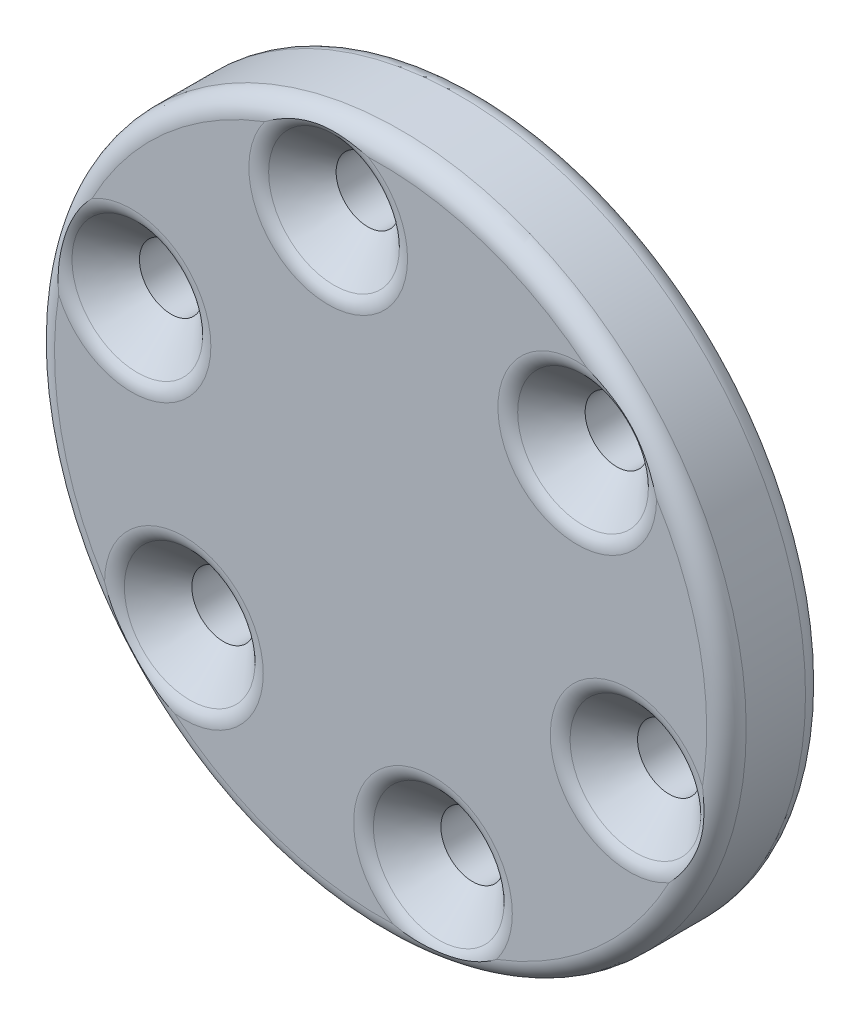
ISO-10303-21;
HEADER;
FILE_DESCRIPTION(('STEP AP214'),'2;1');
FILE_NAME('part.step','',(''),(''),'','','');
FILE_SCHEMA(('AUTOMOTIVE_DESIGN { 1 0 10303 214 1 1 1 1 }'));
ENDSEC;
DATA;
#1=APPLICATION_CONTEXT('core data for automotive mechanical design processes');
#2=APPLICATION_PROTOCOL_DEFINITION('international standard','automotive_design',2000,#1);
#3=PRODUCT_CONTEXT('',#1,'mechanical');
#4=PRODUCT('Part','Part','',(#3));
#5=PRODUCT_RELATED_PRODUCT_CATEGORY('part','',(#4));
#6=PRODUCT_DEFINITION_FORMATION('','',#4);
#7=PRODUCT_DEFINITION_CONTEXT('part definition',#1,'design');
#8=PRODUCT_DEFINITION('design','',#6,#7);
#9=PRODUCT_DEFINITION_SHAPE('','',#8);
#10=(LENGTH_UNIT() NAMED_UNIT(*) SI_UNIT(.MILLI.,.METRE.));
#11=(NAMED_UNIT(*) PLANE_ANGLE_UNIT() SI_UNIT($,.RADIAN.));
#12=(NAMED_UNIT(*) SI_UNIT($,.STERADIAN.) SOLID_ANGLE_UNIT());
#13=UNCERTAINTY_MEASURE_WITH_UNIT(LENGTH_MEASURE(1.E-05),#10,'distance_accuracy_value','');
#14=(GEOMETRIC_REPRESENTATION_CONTEXT(3) GLOBAL_UNCERTAINTY_ASSIGNED_CONTEXT((#13)) GLOBAL_UNIT_ASSIGNED_CONTEXT((#10,
#11,#12)) REPRESENTATION_CONTEXT('',''));
#15=CARTESIAN_POINT('',(0.,0.,0.));
#16=DIRECTION('',(0.,0.,1.));
#17=DIRECTION('',(1.,0.,0.));
#18=AXIS2_PLACEMENT_3D('',#15,#16,#17);
#19=CARTESIAN_POINT('',(-2.65015327966238,13.0205565443838,5.));
#20=DIRECTION('',(0.,0.,-1.));
#21=DIRECTION('',(-1.,0.,0.));
#22=AXIS2_PLACEMENT_3D('',#19,#20,#21);
#23=CYLINDRICAL_SURFACE('',#22,1.6);
#24=CARTESIAN_POINT('',(-2.65015327966238,13.0205565443838,1.));
#25=DIRECTION('',(0.,0.,1.));
#26=DIRECTION('',(1.,0.,0.));
#27=AXIS2_PLACEMENT_3D('',#24,#25,#26);
#28=CIRCLE('',#27,1.6);
#29=CARTESIAN_POINT('',(-1.05015327966238,13.0205565443838,1.));
#30=VERTEX_POINT('',#29);
#31=EDGE_CURVE('E348',#30,#30,#28,.F.);
#32=ORIENTED_EDGE('',*,*,#31,.T.);
#33=EDGE_LOOP('',(#32));
#34=FACE_BOUND('',#33,.T.);
#35=CARTESIAN_POINT('',(-2.65015327966238,13.0205565443838,3.));
#36=DIRECTION('',(0.,0.,1.));
#37=DIRECTION('',(1.,0.,0.));
#38=AXIS2_PLACEMENT_3D('',#35,#36,#37);
#39=CIRCLE('',#38,1.6);
#40=CARTESIAN_POINT('',(-1.05015327966238,13.0205565443838,3.));
#41=VERTEX_POINT('',#40);
#42=EDGE_CURVE('E635',#41,#41,#39,.T.);
#43=ORIENTED_EDGE('',*,*,#42,.T.);
#44=EDGE_LOOP('',(#43));
#45=FACE_BOUND('',#44,.T.);
#46=ADVANCED_FACE('F36',(#34,#45),#23,.F.);
#47=CARTESIAN_POINT('',(9.95105609901738,8.80537833630347,5.));
#48=DIRECTION('',(0.,0.,-1.));
#49=DIRECTION('',(-1.,0.,0.));
#50=AXIS2_PLACEMENT_3D('',#47,#48,#49);
#51=CYLINDRICAL_SURFACE('',#50,1.6);
#52=CARTESIAN_POINT('',(9.95105609901738,8.80537833630347,1.));
#53=DIRECTION('',(0.,0.,1.));
#54=DIRECTION('',(1.,0.,0.));
#55=AXIS2_PLACEMENT_3D('',#52,#53,#54);
#56=CIRCLE('',#55,1.6);
#57=CARTESIAN_POINT('',(11.5510560990174,8.80537833630347,1.));
#58=VERTEX_POINT('',#57);
#59=EDGE_CURVE('E350',#58,#58,#56,.F.);
#60=ORIENTED_EDGE('',*,*,#59,.T.);
#61=EDGE_LOOP('',(#60));
#62=FACE_BOUND('',#61,.T.);
#63=CARTESIAN_POINT('',(9.95105609901738,8.80537833630347,3.));
#64=DIRECTION('',(0.,0.,1.));
#65=DIRECTION('',(1.,0.,0.));
#66=AXIS2_PLACEMENT_3D('',#63,#64,#65);
#67=CIRCLE('',#66,1.6);
#68=CARTESIAN_POINT('',(11.5510560990174,8.80537833630347,3.));
#69=VERTEX_POINT('',#68);
#70=EDGE_CURVE('E637',#69,#69,#67,.T.);
#71=ORIENTED_EDGE('',*,*,#70,.T.);
#72=EDGE_LOOP('',(#71));
#73=FACE_BOUND('',#72,.T.);
#74=ADVANCED_FACE('F240',(#62,#73),#51,.F.);
#75=CARTESIAN_POINT('',(12.6012093786812,-4.21517820808008,5.));
#76=DIRECTION('',(0.,0.,-1.));
#77=DIRECTION('',(-1.,0.,0.));
#78=AXIS2_PLACEMENT_3D('',#75,#76,#77);
#79=CYLINDRICAL_SURFACE('',#78,1.6);
#80=CARTESIAN_POINT('',(12.6012093786812,-4.21517820808008,1.));
#81=DIRECTION('',(0.,0.,1.));
#82=DIRECTION('',(1.,0.,0.));
#83=AXIS2_PLACEMENT_3D('',#80,#81,#82);
#84=CIRCLE('',#83,1.6);
#85=CARTESIAN_POINT('',(14.2012093786812,-4.21517820808008,1.));
#86=VERTEX_POINT('',#85);
#87=EDGE_CURVE('E353',#86,#86,#84,.F.);
#88=ORIENTED_EDGE('',*,*,#87,.T.);
#89=EDGE_LOOP('',(#88));
#90=FACE_BOUND('',#89,.T.);
#91=CARTESIAN_POINT('',(12.6012093786812,-4.21517820808008,3.));
#92=DIRECTION('',(0.,0.,1.));
#93=DIRECTION('',(1.,0.,0.));
#94=AXIS2_PLACEMENT_3D('',#91,#92,#93);
#95=CIRCLE('',#94,1.6);
#96=CARTESIAN_POINT('',(14.2012093786812,-4.21517820808008,3.));
#97=VERTEX_POINT('',#96);
#98=EDGE_CURVE('E370',#97,#97,#95,.T.);
#99=ORIENTED_EDGE('',*,*,#98,.T.);
#100=EDGE_LOOP('',(#99));
#101=FACE_BOUND('',#100,.T.);
#102=ADVANCED_FACE('F246',(#90,#101),#79,.F.);
#103=CARTESIAN_POINT('',(2.65015327966517,-13.0205565443833,5.));
#104=DIRECTION('',(0.,0.,-1.));
#105=DIRECTION('',(-1.,0.,0.));
#106=AXIS2_PLACEMENT_3D('',#103,#104,#105);
#107=CYLINDRICAL_SURFACE('',#106,1.6);
#108=CARTESIAN_POINT('',(2.65015327966517,-13.0205565443833,1.));
#109=DIRECTION('',(0.,0.,1.));
#110=DIRECTION('',(1.,0.,0.));
#111=AXIS2_PLACEMENT_3D('',#108,#109,#110);
#112=CIRCLE('',#111,1.6);
#113=CARTESIAN_POINT('',(4.25015327966517,-13.0205565443833,1.));
#114=VERTEX_POINT('',#113);
#115=EDGE_CURVE('E356',#114,#114,#112,.F.);
#116=ORIENTED_EDGE('',*,*,#115,.T.);
#117=EDGE_LOOP('',(#116));
#118=FACE_BOUND('',#117,.T.);
#119=CARTESIAN_POINT('',(2.65015327966517,-13.0205565443833,3.));
#120=DIRECTION('',(0.,0.,1.));
#121=DIRECTION('',(1.,0.,0.));
#122=AXIS2_PLACEMENT_3D('',#119,#120,#121);
#123=CIRCLE('',#122,1.6);
#124=CARTESIAN_POINT('',(4.25015327966517,-13.0205565443833,3.));
#125=VERTEX_POINT('',#124);
#126=EDGE_CURVE('E364',#125,#125,#123,.T.);
#127=ORIENTED_EDGE('',*,*,#126,.T.);
#128=EDGE_LOOP('',(#127));
#129=FACE_BOUND('',#128,.T.);
#130=ADVANCED_FACE('F257',(#118,#129),#107,.F.);
#131=CARTESIAN_POINT('',(-9.95105609901459,-8.80537833630304,5.));
#132=DIRECTION('',(0.,0.,-1.));
#133=DIRECTION('',(-1.,0.,0.));
#134=AXIS2_PLACEMENT_3D('',#131,#132,#133);
#135=CYLINDRICAL_SURFACE('',#134,1.6);
#136=CARTESIAN_POINT('',(-9.95105609901459,-8.80537833630304,1.));
#137=DIRECTION('',(0.,0.,1.));
#138=DIRECTION('',(1.,0.,0.));
#139=AXIS2_PLACEMENT_3D('',#136,#137,#138);
#140=CIRCLE('',#139,1.6);
#141=CARTESIAN_POINT('',(-8.35105609901459,-8.80537833630304,1.));
#142=VERTEX_POINT('',#141);
#143=EDGE_CURVE('E120',#142,#142,#140,.F.);
#144=ORIENTED_EDGE('',*,*,#143,.T.);
#145=EDGE_LOOP('',(#144));
#146=FACE_BOUND('',#145,.T.);
#147=CARTESIAN_POINT('',(-9.95105609901459,-8.80537833630304,3.));
#148=DIRECTION('',(0.,0.,1.));
#149=DIRECTION('',(1.,0.,0.));
#150=AXIS2_PLACEMENT_3D('',#147,#148,#149);
#151=CIRCLE('',#150,1.6);
#152=CARTESIAN_POINT('',(-8.35105609901459,-8.80537833630304,3.));
#153=VERTEX_POINT('',#152);
#154=EDGE_CURVE('E361',#153,#153,#151,.T.);
#155=ORIENTED_EDGE('',*,*,#154,.T.);
#156=EDGE_LOOP('',(#155));
#157=FACE_BOUND('',#156,.T.);
#158=ADVANCED_FACE('F261',(#146,#157),#135,.F.);
#159=CARTESIAN_POINT('',(-12.6012093786784,4.21517820808051,5.));
#160=DIRECTION('',(0.,0.,-1.));
#161=DIRECTION('',(-1.,0.,0.));
#162=AXIS2_PLACEMENT_3D('',#159,#160,#161);
#163=CYLINDRICAL_SURFACE('',#162,1.6);
#164=CARTESIAN_POINT('',(-12.6012093786784,4.21517820808051,1.));
#165=DIRECTION('',(0.,0.,1.));
#166=DIRECTION('',(1.,0.,0.));
#167=AXIS2_PLACEMENT_3D('',#164,#165,#166);
#168=CIRCLE('',#167,1.6);
#169=CARTESIAN_POINT('',(-11.0012093786784,4.21517820808051,1.));
#170=VERTEX_POINT('',#169);
#171=EDGE_CURVE('E117',#170,#170,#168,.F.);
#172=ORIENTED_EDGE('',*,*,#171,.T.);
#173=EDGE_LOOP('',(#172));
#174=FACE_BOUND('',#173,.T.);
#175=CARTESIAN_POINT('',(-12.6012093786784,4.21517820808051,3.));
#176=DIRECTION('',(0.,0.,1.));
#177=DIRECTION('',(1.,0.,0.));
#178=AXIS2_PLACEMENT_3D('',#175,#176,#177);
#179=CIRCLE('',#178,1.6);
#180=CARTESIAN_POINT('',(-11.0012093786784,4.21517820808051,3.));
#181=VERTEX_POINT('',#180);
#182=EDGE_CURVE('E363',#181,#181,#179,.T.);
#183=ORIENTED_EDGE('',*,*,#182,.T.);
#184=EDGE_LOOP('',(#183));
#185=FACE_BOUND('',#184,.T.);
#186=ADVANCED_FACE('F265',(#174,#185),#163,.F.);
#187=CARTESIAN_POINT('',(0.,0.,5.));
#188=DIRECTION('',(0.,0.,-1.));
#189=DIRECTION('',(-1.,0.,0.));
#190=AXIS2_PLACEMENT_3D('',#187,#188,#189);
#191=CYLINDRICAL_SURFACE('',#190,17.5);
#192=CARTESIAN_POINT('',(0.,0.,1.));
#193=DIRECTION('',(0.,0.,1.));
#194=DIRECTION('',(1.,0.,0.));
#195=AXIS2_PLACEMENT_3D('',#192,#193,#194);
#196=CIRCLE('',#195,17.5);
#197=CARTESIAN_POINT('',(17.5,0.,1.));
#198=VERTEX_POINT('',#197);
#199=EDGE_CURVE('E333',#198,#198,#196,.T.);
#200=ORIENTED_EDGE('',*,*,#199,.T.);
#201=EDGE_LOOP('',(#200));
#202=FACE_BOUND('',#201,.T.);
#203=CARTESIAN_POINT('',(0.,0.,4.));
#204=DIRECTION('',(0.,0.,1.));
#205=DIRECTION('',(1.,0.,0.));
#206=AXIS2_PLACEMENT_3D('',#203,#204,#205);
#207=CIRCLE('',#206,17.5);
#208=CARTESIAN_POINT('',(17.5,0.,4.));
#209=VERTEX_POINT('',#208);
#210=EDGE_CURVE('E367',#209,#209,#207,.F.);
#211=ORIENTED_EDGE('',*,*,#210,.T.);
#212=EDGE_LOOP('',(#211));
#213=FACE_BOUND('',#212,.T.);
#214=ADVANCED_FACE('F252',(#202,#213),#191,.T.);
#215=CARTESIAN_POINT('',(0.,0.,5.));
#216=DIRECTION('',(0.,0.,1.));
#217=DIRECTION('',(1.,0.,0.));
#218=AXIS2_PLACEMENT_3D('',#215,#216,#217);
#219=PLANE('',#218);
#220=CARTESIAN_POINT('',(-9.95105609901459,-8.80537833630304,5.));
#221=DIRECTION('',(0.,0.,1.));
#222=DIRECTION('',(1.,0.,0.));
#223=AXIS2_PLACEMENT_3D('',#220,#221,#222);
#224=CIRCLE('',#223,4.0142135623731);
#225=CARTESIAN_POINT('',(-13.96523039974,-8.78762424561829,5.));
#226=VERTEX_POINT('',#225);
#227=CARTESIAN_POINT('',(-5.93684253664149,-8.80537833630304,5.));
#228=VERTEX_POINT('',#227);
#229=EDGE_CURVE('E63',#226,#228,#224,.F.);
#230=ORIENTED_EDGE('',*,*,#229,.T.);
#231=CARTESIAN_POINT('',(-9.95105609901459,-8.80537833630304,5.));
#232=DIRECTION('',(0.,0.,1.));
#233=DIRECTION('',(1.,0.,0.));
#234=AXIS2_PLACEMENT_3D('',#231,#232,#233);
#235=CIRCLE('',#234,4.0142135623731);
#236=CARTESIAN_POINT('',(-10.4219975750643,-12.7918711119739,5.));
#237=VERTEX_POINT('',#236);
#238=EDGE_CURVE('E58',#228,#237,#235,.F.);
#239=ORIENTED_EDGE('',*,*,#238,.T.);
#240=CARTESIAN_POINT('',(0.,0.,5.));
#241=DIRECTION('',(0.,0.,1.));
#242=DIRECTION('',(1.,0.,0.));
#243=AXIS2_PLACEMENT_3D('',#240,#241,#242);
#244=CIRCLE('',#243,16.5);
#245=CARTESIAN_POINT('',(0.627690635746586,-16.4880564186867,5.));
#246=VERTEX_POINT('',#245);
#247=EDGE_CURVE('E146',#237,#246,#244,.T.);
#248=ORIENTED_EDGE('',*,*,#247,.T.);
#249=CARTESIAN_POINT('',(2.65015327966517,-13.0205565443833,5.));
#250=DIRECTION('',(0.,0.,1.));
#251=DIRECTION('',(1.,0.,0.));
#252=AXIS2_PLACEMENT_3D('',#249,#250,#251);
#253=CIRCLE('',#252,4.0142135623731);
#254=CARTESIAN_POINT('',(6.66436684203827,-13.0205565443833,5.));
#255=VERTEX_POINT('',#254);
#256=EDGE_CURVE('E143',#246,#255,#253,.F.);
#257=ORIENTED_EDGE('',*,*,#256,.T.);
#258=CARTESIAN_POINT('',(2.65015327966517,-13.0205565443833,5.));
#259=DIRECTION('',(0.,0.,1.));
#260=DIRECTION('',(1.,0.,0.));
#261=AXIS2_PLACEMENT_3D('',#258,#259,#260);
#262=CIRCLE('',#261,4.0142135623731);
#263=CARTESIAN_POINT('',(5.86708655737593,-15.4216502141716,5.));
#264=VERTEX_POINT('',#263);
#265=EDGE_CURVE('E141',#255,#264,#262,.F.);
#266=ORIENTED_EDGE('',*,*,#265,.T.);
#267=CARTESIAN_POINT('',(0.,0.,5.));
#268=DIRECTION('',(0.,0.,1.));
#269=DIRECTION('',(1.,0.,0.));
#270=AXIS2_PLACEMENT_3D('',#267,#268,#269);
#271=CIRCLE('',#270,16.5);
#272=CARTESIAN_POINT('',(14.5929210354858,-7.70043217307151,5.));
#273=VERTEX_POINT('',#272);
#274=EDGE_CURVE('E137',#264,#273,#271,.T.);
#275=ORIENTED_EDGE('',*,*,#274,.T.);
#276=CARTESIAN_POINT('',(12.6012093786812,-4.21517820808008,5.));
#277=DIRECTION('',(0.,0.,1.));
#278=DIRECTION('',(1.,0.,0.));
#279=AXIS2_PLACEMENT_3D('',#276,#277,#278);
#280=CIRCLE('',#279,4.0142135623731);
#281=CARTESIAN_POINT('',(16.2890841324384,-2.62977910219536,5.));
#282=VERTEX_POINT('',#281);
#283=EDGE_CURVE('E133',#273,#282,#280,.F.);
#284=ORIENTED_EDGE('',*,*,#283,.T.);
#285=CARTESIAN_POINT('',(0.,0.,5.));
#286=DIRECTION('',(0.,0.,1.));
#287=DIRECTION('',(1.,0.,0.));
#288=AXIS2_PLACEMENT_3D('',#285,#286,#287);
#289=CIRCLE('',#288,16.5);
#290=CARTESIAN_POINT('',(13.9652303997427,8.78762424561389,5.));
#291=VERTEX_POINT('',#290);
#292=EDGE_CURVE('E131',#282,#291,#289,.T.);
#293=ORIENTED_EDGE('',*,*,#292,.T.);
#294=CARTESIAN_POINT('',(9.95105609901738,8.80537833630347,5.));
#295=DIRECTION('',(0.,0.,1.));
#296=DIRECTION('',(1.,0.,0.));
#297=AXIS2_PLACEMENT_3D('',#294,#295,#296);
#298=CIRCLE('',#297,4.0142135623731);
#299=CARTESIAN_POINT('',(10.4219975750632,12.7918711119748,5.));
#300=VERTEX_POINT('',#299);
#301=EDGE_CURVE('E127',#291,#300,#298,.F.);
#302=ORIENTED_EDGE('',*,*,#301,.T.);
#303=CARTESIAN_POINT('',(0.,0.,5.));
#304=DIRECTION('',(0.,0.,1.));
#305=DIRECTION('',(1.,0.,0.));
#306=AXIS2_PLACEMENT_3D('',#303,#304,#305);
#307=CIRCLE('',#306,16.5);
#308=CARTESIAN_POINT('',(-0.627690635743248,16.4880564186868,5.));
#309=VERTEX_POINT('',#308);
#310=EDGE_CURVE('E111',#300,#309,#307,.T.);
#311=ORIENTED_EDGE('',*,*,#310,.T.);
#312=CARTESIAN_POINT('',(-2.65015327966238,13.0205565443838,5.));
#313=DIRECTION('',(0.,0.,1.));
#314=DIRECTION('',(1.,0.,0.));
#315=AXIS2_PLACEMENT_3D('',#312,#313,#314);
#316=CIRCLE('',#315,4.0142135623731);
#317=CARTESIAN_POINT('',(1.36406028271072,13.0205565443838,5.));
#318=VERTEX_POINT('',#317);
#319=EDGE_CURVE('E104',#309,#318,#316,.F.);
#320=ORIENTED_EDGE('',*,*,#319,.T.);
#321=CARTESIAN_POINT('',(-2.65015327966238,13.0205565443838,5.));
#322=DIRECTION('',(0.,0.,1.));
#323=DIRECTION('',(1.,0.,0.));
#324=AXIS2_PLACEMENT_3D('',#321,#322,#323);
#325=CIRCLE('',#324,4.0142135623731);
#326=CARTESIAN_POINT('',(-5.8670865573725,15.4216502141729,5.));
#327=VERTEX_POINT('',#326);
#328=EDGE_CURVE('E108',#318,#327,#325,.F.);
#329=ORIENTED_EDGE('',*,*,#328,.T.);
#330=CARTESIAN_POINT('',(0.,0.,5.));
#331=DIRECTION('',(0.,0.,1.));
#332=DIRECTION('',(1.,0.,0.));
#333=AXIS2_PLACEMENT_3D('',#330,#331,#332);
#334=CIRCLE('',#333,16.5);
#335=CARTESIAN_POINT('',(-14.5929210354867,7.70043217306982,5.));
#336=VERTEX_POINT('',#335);
#337=EDGE_CURVE('E125',#327,#336,#334,.T.);
#338=ORIENTED_EDGE('',*,*,#337,.T.);
#339=CARTESIAN_POINT('',(-12.6012093786784,4.21517820808051,5.));
#340=DIRECTION('',(0.,0.,1.));
#341=DIRECTION('',(1.,0.,0.));
#342=AXIS2_PLACEMENT_3D('',#339,#340,#341);
#343=CIRCLE('',#342,4.0142135623731);
#344=CARTESIAN_POINT('',(-8.58699581630528,4.21517820808051,5.));
#345=VERTEX_POINT('',#344);
#346=EDGE_CURVE('E129',#336,#345,#343,.F.);
#347=ORIENTED_EDGE('',*,*,#346,.T.);
#348=CARTESIAN_POINT('',(-12.6012093786784,4.21517820808051,5.));
#349=DIRECTION('',(0.,0.,1.));
#350=DIRECTION('',(1.,0.,0.));
#351=AXIS2_PLACEMENT_3D('',#348,#349,#350);
#352=CIRCLE('',#351,4.0142135623731);
#353=CARTESIAN_POINT('',(-16.2890841324376,2.62977910220041,5.));
#354=VERTEX_POINT('',#353);
#355=EDGE_CURVE('E135',#345,#354,#352,.F.);
#356=ORIENTED_EDGE('',*,*,#355,.T.);
#357=CARTESIAN_POINT('',(0.,0.,5.));
#358=DIRECTION('',(0.,0.,1.));
#359=DIRECTION('',(1.,0.,0.));
#360=AXIS2_PLACEMENT_3D('',#357,#358,#359);
#361=CIRCLE('',#360,16.5);
#362=EDGE_CURVE('E139',#354,#226,#361,.T.);
#363=ORIENTED_EDGE('',*,*,#362,.T.);
#364=EDGE_LOOP('',(#230,#239,#248,#257,#266,#275,#284,#293,#302,#311,#320,#329,#338,#347,#356,#363));
#365=FACE_BOUND('',#364,.T.);
#366=ADVANCED_FACE('F106',(#365),#219,.T.);
#367=CARTESIAN_POINT('',(0.,0.,0.));
#368=DIRECTION('',(0.,0.,1.));
#369=DIRECTION('',(1.,0.,0.));
#370=AXIS2_PLACEMENT_3D('',#367,#368,#369);
#371=PLANE('',#370);
#372=CARTESIAN_POINT('',(0.,0.,0.));
#373=DIRECTION('',(0.,0.,1.));
#374=DIRECTION('',(1.,0.,0.));
#375=AXIS2_PLACEMENT_3D('',#372,#373,#374);
#376=CIRCLE('',#375,16.5);
#377=CARTESIAN_POINT('',(16.5,0.,0.));
#378=VERTEX_POINT('',#377);
#379=EDGE_CURVE('E345',#378,#378,#376,.F.);
#380=ORIENTED_EDGE('',*,*,#379,.T.);
#381=EDGE_LOOP('',(#380));
#382=FACE_BOUND('',#381,.T.);
#383=CARTESIAN_POINT('',(-2.65015327966238,13.0205565443838,0.));
#384=DIRECTION('',(0.,0.,1.));
#385=DIRECTION('',(1.,0.,0.));
#386=AXIS2_PLACEMENT_3D('',#383,#384,#385);
#387=CIRCLE('',#386,2.6);
#388=CARTESIAN_POINT('',(-0.0501532796623808,13.0205565443838,0.));
#389=VERTEX_POINT('',#388);
#390=EDGE_CURVE('E342',#389,#389,#387,.T.);
#391=ORIENTED_EDGE('',*,*,#390,.T.);
#392=EDGE_LOOP('',(#391));
#393=FACE_BOUND('',#392,.T.);
#394=CARTESIAN_POINT('',(9.95105609901738,8.80537833630347,0.));
#395=DIRECTION('',(0.,0.,1.));
#396=DIRECTION('',(1.,0.,0.));
#397=AXIS2_PLACEMENT_3D('',#394,#395,#396);
#398=CIRCLE('',#397,2.6);
#399=CARTESIAN_POINT('',(12.5510560990174,8.80537833630347,0.));
#400=VERTEX_POINT('',#399);
#401=EDGE_CURVE('E339',#400,#400,#398,.T.);
#402=ORIENTED_EDGE('',*,*,#401,.T.);
#403=EDGE_LOOP('',(#402));
#404=FACE_BOUND('',#403,.T.);
#405=CARTESIAN_POINT('',(12.6012093786812,-4.21517820808008,0.));
#406=DIRECTION('',(0.,0.,1.));
#407=DIRECTION('',(1.,0.,0.));
#408=AXIS2_PLACEMENT_3D('',#405,#406,#407);
#409=CIRCLE('',#408,2.6);
#410=CARTESIAN_POINT('',(15.2012093786812,-4.21517820808008,0.));
#411=VERTEX_POINT('',#410);
#412=EDGE_CURVE('E330',#411,#411,#409,.T.);
#413=ORIENTED_EDGE('',*,*,#412,.T.);
#414=EDGE_LOOP('',(#413));
#415=FACE_BOUND('',#414,.T.);
#416=CARTESIAN_POINT('',(2.65015327966517,-13.0205565443833,0.));
#417=DIRECTION('',(0.,0.,1.));
#418=DIRECTION('',(1.,0.,0.));
#419=AXIS2_PLACEMENT_3D('',#416,#417,#418);
#420=CIRCLE('',#419,2.6);
#421=CARTESIAN_POINT('',(5.25015327966517,-13.0205565443833,0.));
#422=VERTEX_POINT('',#421);
#423=EDGE_CURVE('E326',#422,#422,#420,.T.);
#424=ORIENTED_EDGE('',*,*,#423,.T.);
#425=EDGE_LOOP('',(#424));
#426=FACE_BOUND('',#425,.T.);
#427=CARTESIAN_POINT('',(-9.95105609901459,-8.80537833630304,0.));
#428=DIRECTION('',(0.,0.,1.));
#429=DIRECTION('',(1.,0.,0.));
#430=AXIS2_PLACEMENT_3D('',#427,#428,#429);
#431=CIRCLE('',#430,2.6);
#432=CARTESIAN_POINT('',(-7.35105609901459,-8.80537833630304,0.));
#433=VERTEX_POINT('',#432);
#434=EDGE_CURVE('E324',#433,#433,#431,.T.);
#435=ORIENTED_EDGE('',*,*,#434,.T.);
#436=EDGE_LOOP('',(#435));
#437=FACE_BOUND('',#436,.T.);
#438=CARTESIAN_POINT('',(-12.6012093786784,4.21517820808051,0.));
#439=DIRECTION('',(0.,0.,1.));
#440=DIRECTION('',(1.,0.,0.));
#441=AXIS2_PLACEMENT_3D('',#438,#439,#440);
#442=CIRCLE('',#441,2.6);
#443=CARTESIAN_POINT('',(-10.0012093786784,4.21517820808051,0.));
#444=VERTEX_POINT('',#443);
#445=EDGE_CURVE('E327',#444,#444,#442,.T.);
#446=ORIENTED_EDGE('',*,*,#445,.T.);
#447=EDGE_LOOP('',(#446));
#448=FACE_BOUND('',#447,.T.);
#449=ADVANCED_FACE('F274',(#382,#393,#404,#415,#426,#437,#448),#371,.F.);
#450=CARTESIAN_POINT('',(-2.65015327966238,13.0205565443838,3.));
#451=DIRECTION('',(0.,0.,1.));
#452=DIRECTION('',(1.,0.,0.));
#453=AXIS2_PLACEMENT_3D('',#450,#451,#452);
#454=CONICAL_SURFACE('',#453,1.6,0.785398163397449);
#455=CARTESIAN_POINT('',(-2.65015327966238,13.0205565443838,4.70710678118655));
#456=DIRECTION('',(0.,0.,-1.));
#457=DIRECTION('',(-1.,0.,0.));
#458=AXIS2_PLACEMENT_3D('',#455,#456,#457);
#459=CIRCLE('',#458,3.30710678118655);
#460=CARTESIAN_POINT('',(-5.95726006084894,13.0205565443838,4.70710678118655));
#461=VERTEX_POINT('',#460);
#462=EDGE_CURVE('E11',#461,#461,#459,.F.);
#463=ORIENTED_EDGE('',*,*,#462,.T.);
#464=EDGE_LOOP('',(#463));
#465=FACE_BOUND('',#464,.T.);
#466=ORIENTED_EDGE('',*,*,#42,.F.);
#467=EDGE_LOOP('',(#466));
#468=FACE_BOUND('',#467,.T.);
#469=ADVANCED_FACE('F270',(#465,#468),#454,.F.);
#470=CARTESIAN_POINT('',(9.95105609901738,8.80537833630347,3.));
#471=DIRECTION('',(0.,0.,1.));
#472=DIRECTION('',(1.,0.,0.));
#473=AXIS2_PLACEMENT_3D('',#470,#471,#472);
#474=CONICAL_SURFACE('',#473,1.6,0.785398163397449);
#475=CARTESIAN_POINT('',(9.95105609901738,8.80537833630347,4.70710678118655));
#476=DIRECTION('',(0.,0.,-1.));
#477=DIRECTION('',(-1.,0.,0.));
#478=AXIS2_PLACEMENT_3D('',#475,#476,#477);
#479=CIRCLE('',#478,3.30710678118655);
#480=CARTESIAN_POINT('',(6.64394931783083,8.80537833630347,4.70710678118655));
#481=VERTEX_POINT('',#480);
#482=EDGE_CURVE('E50',#481,#481,#479,.F.);
#483=ORIENTED_EDGE('',*,*,#482,.T.);
#484=EDGE_LOOP('',(#483));
#485=FACE_BOUND('',#484,.T.);
#486=ORIENTED_EDGE('',*,*,#70,.F.);
#487=EDGE_LOOP('',(#486));
#488=FACE_BOUND('',#487,.T.);
#489=ADVANCED_FACE('F273',(#485,#488),#474,.F.);
#490=CARTESIAN_POINT('',(12.6012093786812,-4.21517820808008,3.));
#491=DIRECTION('',(0.,0.,1.));
#492=DIRECTION('',(1.,0.,0.));
#493=AXIS2_PLACEMENT_3D('',#490,#491,#492);
#494=CONICAL_SURFACE('',#493,1.6,0.785398163397448);
#495=CARTESIAN_POINT('',(12.6012093786812,-4.21517820808008,4.70710678118655));
#496=DIRECTION('',(0.,0.,-1.));
#497=DIRECTION('',(-1.,0.,0.));
#498=AXIS2_PLACEMENT_3D('',#495,#496,#497);
#499=CIRCLE('',#498,3.30710678118655);
#500=CARTESIAN_POINT('',(9.29410259749461,-4.21517820808008,4.70710678118655));
#501=VERTEX_POINT('',#500);
#502=EDGE_CURVE('E158',#501,#501,#499,.F.);
#503=ORIENTED_EDGE('',*,*,#502,.T.);
#504=EDGE_LOOP('',(#503));
#505=FACE_BOUND('',#504,.T.);
#506=ORIENTED_EDGE('',*,*,#98,.F.);
#507=EDGE_LOOP('',(#506));
#508=FACE_BOUND('',#507,.T.);
#509=ADVANCED_FACE('F278',(#505,#508),#494,.F.);
#510=CARTESIAN_POINT('',(2.65015327966517,-13.0205565443833,3.));
#511=DIRECTION('',(0.,0.,1.));
#512=DIRECTION('',(1.,0.,0.));
#513=AXIS2_PLACEMENT_3D('',#510,#511,#512);
#514=CONICAL_SURFACE('',#513,1.6,0.785398163397449);
#515=CARTESIAN_POINT('',(2.65015327966517,-13.0205565443833,4.70710678118655));
#516=DIRECTION('',(0.,0.,-1.));
#517=DIRECTION('',(-1.,0.,0.));
#518=AXIS2_PLACEMENT_3D('',#515,#516,#517);
#519=CIRCLE('',#518,3.30710678118655);
#520=CARTESIAN_POINT('',(-0.656953501521382,-13.0205565443833,4.70710678118655));
#521=VERTEX_POINT('',#520);
#522=EDGE_CURVE('E155',#521,#521,#519,.F.);
#523=ORIENTED_EDGE('',*,*,#522,.T.);
#524=EDGE_LOOP('',(#523));
#525=FACE_BOUND('',#524,.T.);
#526=ORIENTED_EDGE('',*,*,#126,.F.);
#527=EDGE_LOOP('',(#526));
#528=FACE_BOUND('',#527,.T.);
#529=ADVANCED_FACE('F282',(#525,#528),#514,.F.);
#530=CARTESIAN_POINT('',(-9.95105609901459,-8.80537833630304,3.));
#531=DIRECTION('',(0.,0.,1.));
#532=DIRECTION('',(1.,0.,0.));
#533=AXIS2_PLACEMENT_3D('',#530,#531,#532);
#534=CONICAL_SURFACE('',#533,1.6,0.785398163397449);
#535=CARTESIAN_POINT('',(-9.95105609901459,-8.80537833630304,4.70710678118655));
#536=DIRECTION('',(0.,0.,-1.));
#537=DIRECTION('',(-1.,0.,0.));
#538=AXIS2_PLACEMENT_3D('',#535,#536,#537);
#539=CIRCLE('',#538,3.30710678118655);
#540=CARTESIAN_POINT('',(-13.2581628802011,-8.80537833630304,4.70710678118655));
#541=VERTEX_POINT('',#540);
#542=EDGE_CURVE('E152',#541,#541,#539,.F.);
#543=ORIENTED_EDGE('',*,*,#542,.T.);
#544=EDGE_LOOP('',(#543));
#545=FACE_BOUND('',#544,.T.);
#546=ORIENTED_EDGE('',*,*,#154,.F.);
#547=EDGE_LOOP('',(#546));
#548=FACE_BOUND('',#547,.T.);
#549=ADVANCED_FACE('F286',(#545,#548),#534,.F.);
#550=CARTESIAN_POINT('',(-12.6012093786784,4.21517820808051,3.));
#551=DIRECTION('',(0.,0.,1.));
#552=DIRECTION('',(1.,0.,0.));
#553=AXIS2_PLACEMENT_3D('',#550,#551,#552);
#554=CONICAL_SURFACE('',#553,1.6,0.785398163397448);
#555=CARTESIAN_POINT('',(-12.6012093786784,4.21517820808051,4.70710678118655));
#556=DIRECTION('',(0.,0.,-1.));
#557=DIRECTION('',(-1.,0.,0.));
#558=AXIS2_PLACEMENT_3D('',#555,#556,#557);
#559=CIRCLE('',#558,3.30710678118655);
#560=CARTESIAN_POINT('',(-15.9083161598649,4.21517820808051,4.70710678118655));
#561=VERTEX_POINT('',#560);
#562=EDGE_CURVE('E149',#561,#561,#559,.F.);
#563=ORIENTED_EDGE('',*,*,#562,.T.);
#564=EDGE_LOOP('',(#563));
#565=FACE_BOUND('',#564,.T.);
#566=ORIENTED_EDGE('',*,*,#182,.F.);
#567=EDGE_LOOP('',(#566));
#568=FACE_BOUND('',#567,.T.);
#569=ADVANCED_FACE('F290',(#565,#568),#554,.F.);
#570=CARTESIAN_POINT('',(0.,0.,1.));
#571=DIRECTION('',(0.,0.,1.));
#572=DIRECTION('',(1.,0.,0.));
#573=AXIS2_PLACEMENT_3D('',#570,#571,#572);
#574=TOROIDAL_SURFACE('',#573,16.5,1.);
#575=ORIENTED_EDGE('',*,*,#379,.F.);
#576=EDGE_LOOP('',(#575));
#577=FACE_BOUND('',#576,.T.);
#578=ORIENTED_EDGE('',*,*,#199,.F.);
#579=EDGE_LOOP('',(#578));
#580=FACE_BOUND('',#579,.T.);
#581=ADVANCED_FACE('F294',(#577,#580),#574,.T.);
#582=CARTESIAN_POINT('',(-2.65015327966238,13.0205565443838,1.));
#583=DIRECTION('',(0.,0.,1.));
#584=DIRECTION('',(1.,0.,0.));
#585=AXIS2_PLACEMENT_3D('',#582,#583,#584);
#586=TOROIDAL_SURFACE('',#585,2.6,1.);
#587=ORIENTED_EDGE('',*,*,#31,.F.);
#588=EDGE_LOOP('',(#587));
#589=FACE_BOUND('',#588,.T.);
#590=ORIENTED_EDGE('',*,*,#390,.F.);
#591=EDGE_LOOP('',(#590));
#592=FACE_BOUND('',#591,.T.);
#593=ADVANCED_FACE('F298',(#589,#592),#586,.T.);
#594=CARTESIAN_POINT('',(9.95105609901738,8.80537833630347,1.));
#595=DIRECTION('',(0.,0.,1.));
#596=DIRECTION('',(1.,0.,0.));
#597=AXIS2_PLACEMENT_3D('',#594,#595,#596);
#598=TOROIDAL_SURFACE('',#597,2.6,1.);
#599=ORIENTED_EDGE('',*,*,#59,.F.);
#600=EDGE_LOOP('',(#599));
#601=FACE_BOUND('',#600,.T.);
#602=ORIENTED_EDGE('',*,*,#401,.F.);
#603=EDGE_LOOP('',(#602));
#604=FACE_BOUND('',#603,.T.);
#605=ADVANCED_FACE('F302',(#601,#604),#598,.T.);
#606=CARTESIAN_POINT('',(12.6012093786812,-4.21517820808008,1.));
#607=DIRECTION('',(0.,0.,1.));
#608=DIRECTION('',(1.,0.,0.));
#609=AXIS2_PLACEMENT_3D('',#606,#607,#608);
#610=TOROIDAL_SURFACE('',#609,2.6,1.);
#611=ORIENTED_EDGE('',*,*,#87,.F.);
#612=EDGE_LOOP('',(#611));
#613=FACE_BOUND('',#612,.T.);
#614=ORIENTED_EDGE('',*,*,#412,.F.);
#615=EDGE_LOOP('',(#614));
#616=FACE_BOUND('',#615,.T.);
#617=ADVANCED_FACE('F306',(#613,#616),#610,.T.);
#618=CARTESIAN_POINT('',(2.65015327966517,-13.0205565443833,1.));
#619=DIRECTION('',(0.,0.,1.));
#620=DIRECTION('',(1.,0.,0.));
#621=AXIS2_PLACEMENT_3D('',#618,#619,#620);
#622=TOROIDAL_SURFACE('',#621,2.6,1.);
#623=ORIENTED_EDGE('',*,*,#115,.F.);
#624=EDGE_LOOP('',(#623));
#625=FACE_BOUND('',#624,.T.);
#626=ORIENTED_EDGE('',*,*,#423,.F.);
#627=EDGE_LOOP('',(#626));
#628=FACE_BOUND('',#627,.T.);
#629=ADVANCED_FACE('F310',(#625,#628),#622,.T.);
#630=CARTESIAN_POINT('',(-9.95105609901459,-8.80537833630304,1.));
#631=DIRECTION('',(0.,0.,1.));
#632=DIRECTION('',(1.,0.,0.));
#633=AXIS2_PLACEMENT_3D('',#630,#631,#632);
#634=TOROIDAL_SURFACE('',#633,2.6,1.);
#635=ORIENTED_EDGE('',*,*,#143,.F.);
#636=EDGE_LOOP('',(#635));
#637=FACE_BOUND('',#636,.T.);
#638=ORIENTED_EDGE('',*,*,#434,.F.);
#639=EDGE_LOOP('',(#638));
#640=FACE_BOUND('',#639,.T.);
#641=ADVANCED_FACE('F236',(#637,#640),#634,.T.);
#642=CARTESIAN_POINT('',(-12.6012093786784,4.21517820808051,1.));
#643=DIRECTION('',(0.,0.,1.));
#644=DIRECTION('',(1.,0.,0.));
#645=AXIS2_PLACEMENT_3D('',#642,#643,#644);
#646=TOROIDAL_SURFACE('',#645,2.6,1.);
#647=ORIENTED_EDGE('',*,*,#171,.F.);
#648=EDGE_LOOP('',(#647));
#649=FACE_BOUND('',#648,.T.);
#650=ORIENTED_EDGE('',*,*,#445,.F.);
#651=EDGE_LOOP('',(#650));
#652=FACE_BOUND('',#651,.T.);
#653=ADVANCED_FACE('F230',(#649,#652),#646,.T.);
#654=CARTESIAN_POINT('',(-2.65015327966238,13.0205565443838,4.));
#655=DIRECTION('',(0.,0.,1.));
#656=DIRECTION('',(1.,0.,0.));
#657=AXIS2_PLACEMENT_3D('',#654,#655,#656);
#658=TOROIDAL_SURFACE('',#657,4.0142135623731,1.);
#659=ORIENTED_EDGE('',*,*,#462,.F.);
#660=EDGE_LOOP('',(#659));
#661=FACE_BOUND('',#660,.T.);
#662=ORIENTED_EDGE('',*,*,#328,.F.);
#663=ORIENTED_EDGE('',*,*,#319,.F.);
#664=CARTESIAN_POINT('',(-0.627690635743256,16.4880564186868,5.00000000000001));
#665=CARTESIAN_POINT('',(-0.630483357944817,16.4887546221146,4.99999999496241));
#666=CARTESIAN_POINT('',(-0.63327655033944,16.4894510345053,4.99999902567045));
#667=CARTESIAN_POINT('',(-0.800381147444526,16.5310001610585,4.99988380228398));
#668=CARTESIAN_POINT('',(-0.966308462622403,16.5656526938622,4.99645991685647));
#669=CARTESIAN_POINT('',(-1.30033406227146,16.6218382926356,4.98593220326691));
#670=CARTESIAN_POINT('',(-1.46843396503105,16.643360925805,4.9788254570352));
#671=CARTESIAN_POINT('',(-1.80616961337385,16.6727578098223,4.96354289300826));
#672=CARTESIAN_POINT('',(-1.97580793864603,16.680601679875,4.95536473876258));
#673=CARTESIAN_POINT('',(-2.31516871677905,16.6821406552161,4.94029466141036));
#674=CARTESIAN_POINT('',(-2.48489113253361,16.6758397413298,4.93340237700742));
#675=CARTESIAN_POINT('',(-2.82369108421707,16.6488397513169,4.92271979455607));
#676=CARTESIAN_POINT('',(-2.99276627055931,16.6281079107728,4.91893659818452));
#677=CARTESIAN_POINT('',(-3.32857877125074,16.5722232353288,4.91550172408997));
#678=CARTESIAN_POINT('',(-3.49531588603569,16.5370691770874,4.9158503969161));
#679=CARTESIAN_POINT('',(-3.8249867128348,16.4526646375878,4.92058614841053));
#680=CARTESIAN_POINT('',(-3.98792314615661,16.4034245993544,4.92497024063101));
#681=CARTESIAN_POINT('',(-4.30889952460265,16.2913863957468,4.93660836512742));
#682=CARTESIAN_POINT('',(-4.46694045104232,16.2285909679565,4.94386181816638));
#683=CARTESIAN_POINT('',(-4.81366672431785,16.0738509864973,4.96111983678677));
#684=CARTESIAN_POINT('',(-5.00083361999336,15.9785242015728,4.97137046114723));
#685=CARTESIAN_POINT('',(-5.36465309715247,15.7698493155111,4.98870104727436));
#686=CARTESIAN_POINT('',(-5.54132167658005,15.6565296538972,4.99578594648221));
#687=CARTESIAN_POINT('',(-5.76202204675476,15.499706997849,4.99948101632031));
#688=CARTESIAN_POINT('',(-5.81135734401293,15.4636121450658,4.99995606091975));
#689=CARTESIAN_POINT('',(-5.86249016770068,15.4251171861677,4.99999903214848));
#690=CARTESIAN_POINT('',(-5.86478886953667,15.4233843040018,5.00000000225762));
#691=CARTESIAN_POINT('',(-5.86708645632085,15.4216499407206,5.00000000193267));
#692=B_SPLINE_CURVE_WITH_KNOTS('',3,(#664,#665,#666,#667,#668,#669,#670,#671,#672,#673,#674,
#675,#676,#677,#678,#679,#680,#681,#682,#683,#684,#685,#686,#687,#688,#689,#690,#691),
.UNSPECIFIED.,.F.,.F.,(4,2,2,2,2,2,2,2,2,2,2,2,2,4),(0.,0.00863609734735337,0.516573866236208,
1.02491471013523,1.53438315765943,2.04370824133685,2.55419350024899,3.06472206920703,
3.57487312048778,4.08492124024323,4.71473802773347,5.34356905958262,5.52694312292643,
5.53557921984481),.UNSPECIFIED.);
#693=EDGE_CURVE('E40',#327,#309,#692,.F.);
#694=ORIENTED_EDGE('',*,*,#693,.F.);
#695=EDGE_LOOP('',(#662,#663,#694));
#696=FACE_BOUND('',#695,.T.);
#697=ADVANCED_FACE('F115',(#661,#696),#658,.T.);
#698=CARTESIAN_POINT('',(-12.6012093786784,4.21517820808051,4.));
#699=DIRECTION('',(0.,0.,1.));
#700=DIRECTION('',(1.,0.,0.));
#701=AXIS2_PLACEMENT_3D('',#698,#699,#700);
#702=TOROIDAL_SURFACE('',#701,4.0142135623731,1.);
#703=ORIENTED_EDGE('',*,*,#562,.F.);
#704=EDGE_LOOP('',(#703));
#705=FACE_BOUND('',#704,.T.);
#706=ORIENTED_EDGE('',*,*,#355,.F.);
#707=ORIENTED_EDGE('',*,*,#346,.F.);
#708=CARTESIAN_POINT('',(-14.5929210354867,7.70043217306984,5.00000000000115));
#709=CARTESIAN_POINT('',(-14.594922058493,7.69836270641145,4.99999999496316));
#710=CARTESIAN_POINT('',(-14.5969217655121,7.6962919370354,4.99999902567082));
#711=CARTESIAN_POINT('',(-14.7164566841242,7.57234965239725,4.99988380224206));
#712=CARTESIAN_POINT('',(-14.8294303347508,7.44597862533008,4.99645991563436));
#713=CARTESIAN_POINT('',(-15.045101326035,7.18479671937753,4.98593219881897));
#714=CARTESIAN_POINT('',(-15.1477904406905,7.04997922255201,4.97882545051499));
#715=CARTESIAN_POINT('',(-15.3421167066848,6.77219000511154,4.96354288555712));
#716=CARTESIAN_POINT('',(-15.4337288413024,6.62920086279223,4.95536473282608));
#717=CARTESIAN_POINT('',(-15.6047419866499,6.33607534589637,4.94029465869716));
#718=CARTESIAN_POINT('',(-15.6841464266787,6.18594099407757,4.93340237596524));
#719=CARTESIAN_POINT('',(-15.8301636685464,5.87903175069431,4.92271979755609));
#720=CARTESIAN_POINT('',(-15.8967469255396,5.72224251404006,4.91893660240909));
#721=CARTESIAN_POINT('',(-16.0162555854526,5.40347819081749,4.91550172551592));
#722=CARTESIAN_POINT('',(-16.0691798280013,5.24150266497256,4.9158503946651));
#723=CARTESIAN_POINT('',(-16.1609187831181,4.91379707104486,4.92058613848084));
#724=CARTESIAN_POINT('',(-16.1997438848167,4.74806986349116,4.92497023113982));
#725=CARTESIAN_POINT('',(-16.2632042581356,4.41407688367928,4.93660835882101));
#726=CARTESIAN_POINT('',(-16.2878423941064,4.24581163089797,4.94386181401924));
#727=CARTESIAN_POINT('',(-16.3271965044886,3.8681677292389,4.96111984318012));
#728=CARTESIAN_POINT('',(-16.3382240309611,3.65841299590811,4.97137047715584));
#729=CARTESIAN_POINT('',(-16.3394173225434,3.23899847972286,4.98870105042528));
#730=CARTESIAN_POINT('',(-16.3296157353056,3.02933906270896,4.99578593066891));
#731=CARTESIAN_POINT('',(-16.3041503105262,2.75979614664356,4.99948102100872));
#732=CARTESIAN_POINT('',(-16.2975578087971,2.69902326199546,4.99995607318756));
#733=CARTESIAN_POINT('',(-16.289788519449,2.63549325144528,4.99999903151246));
#734=CARTESIAN_POINT('',(-16.2894372426434,2.63263606468871,5.00000000099704));
#735=CARTESIAN_POINT('',(-16.2890841324376,2.62977910220039,5.));
#736=B_SPLINE_CURVE_WITH_KNOTS('',3,(#708,#709,#710,#711,#712,#713,#714,#715,#716,#717,#718,
#719,#720,#721,#722,#723,#724,#725,#726,#727,#728,#729,#730,#731,#732,#733,#734,#735),
.UNSPECIFIED.,.F.,.F.,(4,2,2,2,2,2,2,2,2,2,2,2,2,4),(0.,0.00863609734736057,0.51657395681386,
1.02491489495003,1.53438325752952,2.0437082413419,2.55419321351886,3.06472153854406,
3.5748729072971,4.08492124026505,4.71473837503353,5.34356905959991,5.5269430386105,
5.53557913595786),.UNSPECIFIED.);
#737=EDGE_CURVE('E211',#354,#336,#736,.F.);
#738=ORIENTED_EDGE('',*,*,#737,.F.);
#739=EDGE_LOOP('',(#706,#707,#738));
#740=FACE_BOUND('',#739,.T.);
#741=ADVANCED_FACE('F222',(#705,#740),#702,.T.);
#742=CARTESIAN_POINT('',(-9.95105609901459,-8.80537833630304,4.));
#743=DIRECTION('',(0.,0.,1.));
#744=DIRECTION('',(1.,0.,0.));
#745=AXIS2_PLACEMENT_3D('',#742,#743,#744);
#746=TOROIDAL_SURFACE('',#745,4.0142135623731,1.);
#747=ORIENTED_EDGE('',*,*,#542,.F.);
#748=EDGE_LOOP('',(#747));
#749=FACE_BOUND('',#748,.T.);
#750=ORIENTED_EDGE('',*,*,#238,.F.);
#751=ORIENTED_EDGE('',*,*,#229,.F.);
#752=CARTESIAN_POINT('',(-10.4219975750643,-12.7918711119739,5.));
#753=CARTESIAN_POINT('',(-10.4246483122056,-12.7907484464272,4.99999999496241));
#754=CARTESIAN_POINT('',(-10.4272983472624,-12.7896240674125,4.99999902567045));
#755=CARTESIAN_POINT('',(-10.5857697709797,-12.7222661090576,4.99988380226399));
#756=CARTESIAN_POINT('',(-10.7391512733876,-12.6501079706613,4.99645991564026));
#757=CARTESIAN_POINT('',(-11.0397544943844,-12.4940065036458,4.98593219881315));
#758=CARTESIAN_POINT('',(-11.1869712282315,-12.4100538682231,4.97882545051349));
#759=CARTESIAN_POINT('',(-11.4744193221455,-12.2303231243675,4.96354288555878));
#760=CARTESIAN_POINT('',(-11.6146344655554,-12.1345192017492,4.95536473282655));
#761=CARTESIAN_POINT('',(-11.8866188264585,-11.9315596689313,4.94029465869675));
#762=CARTESIAN_POINT('',(-12.0183904097682,-11.8244072610046,4.93340237596512));
#763=CARTESIAN_POINT('',(-12.2727552651525,-11.598990227615,4.92271979755619));
#764=CARTESIAN_POINT('',(-12.3953269501097,-11.480700849862,4.91893660240911));
#765=CARTESIAN_POINT('',(-12.6299260992537,-11.2340102485521,4.91550172551587));
#766=CARTESIAN_POINT('',(-12.7419526670902,-11.1056081671015,4.91585039466507));
#767=CARTESIAN_POINT('',(-12.9544863720449,-10.8398330432925,4.92058613848083));
#768=CARTESIAN_POINT('',(-13.0550019536329,-10.7024666947807,4.9249702311398));
#769=CARTESIAN_POINT('',(-13.2439644741082,-10.41985088595,4.93660835882099));
#770=CARTESIAN_POINT('',(-13.3324138464111,-10.2746030233945,4.94386181401921));
#771=CARTESIAN_POINT('',(-13.5162501911899,-9.94238643620679,4.96111984318011));
#772=CARTESIAN_POINT('',(-13.6083891650314,-9.75362980984831,4.97137047715583));
#773=CARTESIAN_POINT('',(-13.7734279580319,-9.36804952360859,4.98870105042528));
#774=CARTESIAN_POINT('',(-13.8463576844606,-9.17123896175268,4.99578593066891));
#775=CARTESIAN_POINT('',(-13.9282769755968,-8.91318644539211,4.99948102100872));
#776=CARTESIAN_POINT('',(-13.9459638208032,-8.85467166013107,4.99995607318756));
#777=CARTESIAN_POINT('',(-13.9636452046504,-8.79315911862344,4.99999903151246));
#778=CARTESIAN_POINT('',(-13.9644386897953,-8.79039193722697,5.00000000099704));
#779=CARTESIAN_POINT('',(-13.96523039974,-8.78762424561831,5.));
#780=B_SPLINE_CURVE_WITH_KNOTS('',3,(#752,#753,#754,#755,#756,#757,#758,#759,#760,#761,#762,
#763,#764,#765,#766,#767,#768,#769,#770,#771,#772,#773,#774,#775,#776,#777,#778,#779),
.UNSPECIFIED.,.F.,.F.,(4,2,2,2,2,2,2,2,2,2,2,2,2,4),(0.,0.00863609734735624,0.51657395681221,
1.02491489494804,1.53438325752872,2.04370824134177,2.55419321351866,3.06472153854383,
3.57487290729691,4.08492124026492,4.71473837503357,5.34356905960006,5.52694303861071,
5.53557913595806),.UNSPECIFIED.);
#781=EDGE_CURVE('E204',#237,#226,#780,.T.);
#782=ORIENTED_EDGE('',*,*,#781,.F.);
#783=EDGE_LOOP('',(#750,#751,#782));
#784=FACE_BOUND('',#783,.T.);
#785=ADVANCED_FACE('F219',(#749,#784),#746,.T.);
#786=CARTESIAN_POINT('',(2.65015327966517,-13.0205565443833,4.));
#787=DIRECTION('',(0.,0.,1.));
#788=DIRECTION('',(1.,0.,0.));
#789=AXIS2_PLACEMENT_3D('',#786,#787,#788);
#790=TOROIDAL_SURFACE('',#789,4.0142135623731,1.);
#791=ORIENTED_EDGE('',*,*,#522,.F.);
#792=EDGE_LOOP('',(#791));
#793=FACE_BOUND('',#792,.T.);
#794=ORIENTED_EDGE('',*,*,#265,.F.);
#795=ORIENTED_EDGE('',*,*,#256,.F.);
#796=CARTESIAN_POINT('',(5.86708655737593,-15.4216502141716,5.00000000000256));
#797=CARTESIAN_POINT('',(5.86478893192191,-15.4233844871013,4.99999999496409));
#798=CARTESIAN_POINT('',(5.86249017360324,-15.4251172952741,4.99999902567127));
#799=CARTESIAN_POINT('',(5.72492075866088,-15.5286785948101,4.99988380221532));
#800=CARTESIAN_POINT('',(5.5857392265151,-15.6254318031689,4.99645991562715));
#801=CARTESIAN_POINT('',(5.300249780012,-15.8077110955049,4.98593219882602));
#802=CARTESIAN_POINT('',(5.15393629809743,-15.8932282091673,4.97882545051676));
#803=CARTESIAN_POINT('',(4.85456086112076,-16.052300188838,4.963542885555));
#804=CARTESIAN_POINT('',(4.70148465864691,-16.1258281037168,4.95536473282537));
#805=CARTESIAN_POINT('',(4.38972436683602,-16.2598937032815,4.94029465869747));
#806=CARTESIAN_POINT('',(4.23104186784041,-16.320435037961,4.93340237596516));
#807=CARTESIAN_POINT('',(3.9086425627875,-16.428012947859,4.9227197975557));
#808=CARTESIAN_POINT('',(3.74491511417691,-16.4750184519402,4.91893660240878));
#809=CARTESIAN_POINT('',(3.4139752119956,-16.5548419741501,4.91550172551567));
#810=CARTESIAN_POINT('',(3.24676246364226,-16.5876587870701,4.91585039466481));
#811=CARTESIAN_POINT('',(2.9103276022524,-16.6388308128168,4.92058613848053));
#812=CARTESIAN_POINT('',(2.74110706402208,-16.6571966856924,4.92497023113952));
#813=CARTESIAN_POINT('',(2.40187333382603,-16.6795351243718,4.93660835882073));
#814=CARTESIAN_POINT('',(2.23186030885626,-16.6835105964571,4.94386181401897));
#815=CARTESIAN_POINT('',(1.85223413240337,-16.6766092475807,4.96111984317991));
#816=CARTESIAN_POINT('',(1.64269661192316,-16.6620256264268,4.97137047715568));
#817=CARTESIAN_POINT('',(1.22625489234005,-16.6121632706552,4.98870105042521));
#818=CARTESIAN_POINT('',(1.01934708282499,-16.5769169855053,4.99578593066889));
#819=CARTESIAN_POINT('',(0.754907402577592,-16.5188349145089,4.99948102100871));
#820=CARTESIAN_POINT('',(0.695388689441202,-16.50489477914,4.99995607318756));
#821=CARTESIAN_POINT('',(0.63327657392052,-16.4894510359718,4.99999903151246));
#822=CARTESIAN_POINT('',(0.630483381961859,-16.4887546235665,5.00000000099704));
#823=CARTESIAN_POINT('',(0.627690635746588,-16.4880564186867,5.));
#824=B_SPLINE_CURVE_WITH_KNOTS('',3,(#796,#797,#798,#799,#800,#801,#802,#803,#804,#805,#806,
#807,#808,#809,#810,#811,#812,#813,#814,#815,#816,#817,#818,#819,#820,#821,#822,#823),
.UNSPECIFIED.,.F.,.F.,(4,2,2,2,2,2,2,2,2,2,2,2,2,4),(0.,0.00863609734734593,0.516573956816114,
1.02491489495291,1.5343832575311,2.04370824134283,2.5541932135199,3.06472153854514,
3.57487290729813,4.08492124026601,4.71473837503575,5.34356905960355,5.52694303861459,
5.53557913596194),.UNSPECIFIED.);
#825=EDGE_CURVE('E197',#264,#246,#824,.T.);
#826=ORIENTED_EDGE('',*,*,#825,.F.);
#827=EDGE_LOOP('',(#794,#795,#826));
#828=FACE_BOUND('',#827,.T.);
#829=ADVANCED_FACE('F189',(#793,#828),#790,.T.);
#830=CARTESIAN_POINT('',(12.6012093786812,-4.21517820808008,4.));
#831=DIRECTION('',(0.,0.,1.));
#832=DIRECTION('',(1.,0.,0.));
#833=AXIS2_PLACEMENT_3D('',#830,#831,#832);
#834=TOROIDAL_SURFACE('',#833,4.0142135623731,1.);
#835=ORIENTED_EDGE('',*,*,#502,.F.);
#836=EDGE_LOOP('',(#835));
#837=FACE_BOUND('',#836,.T.);
#838=CARTESIAN_POINT('',(14.5929210354858,-7.70043217307151,5.00000000000095));
#839=CARTESIAN_POINT('',(14.5949220584921,-7.69836270641312,4.99999999496303));
#840=CARTESIAN_POINT('',(14.5969217655112,-7.69629193703707,4.99999902567075));
#841=CARTESIAN_POINT('',(14.7164566841233,-7.57234965239905,4.99988380224596));
#842=CARTESIAN_POINT('',(14.82943033475,-7.445978625332,4.99645991563539));
#843=CARTESIAN_POINT('',(15.0451013260343,-7.18479671937966,4.98593219881788));
#844=CARTESIAN_POINT('',(15.1477904406899,-7.0499792225542,4.97882545051464));
#845=CARTESIAN_POINT('',(15.3421167066844,-6.77219000511379,4.96354288555726));
#846=CARTESIAN_POINT('',(15.4337288413021,-6.62920086279447,4.95536473282596));
#847=CARTESIAN_POINT('',(15.6047419866498,-6.33607534589858,4.9402946586968));
#848=CARTESIAN_POINT('',(15.6841464266787,-6.18594099407977,4.93340237596488));
#849=CARTESIAN_POINT('',(15.8301636685466,-5.87903175069655,4.92271979755568));
#850=CARTESIAN_POINT('',(15.8967469255399,-5.72224251404234,4.91893660240862));
#851=CARTESIAN_POINT('',(16.0162555854531,-5.40347819081984,4.91550172551537));
#852=CARTESIAN_POINT('',(16.0691798280019,-5.24150266497494,4.91585039466452));
#853=CARTESIAN_POINT('',(16.1609187831189,-4.91379707104728,4.92058613848023));
#854=CARTESIAN_POINT('',(16.1997438848175,-4.74806986349359,4.9249702311392));
#855=CARTESIAN_POINT('',(16.2632042581366,-4.41407688368172,4.9366083588204));
#856=CARTESIAN_POINT('',(16.2878423941075,-4.24581163090041,4.94386181401865));
#857=CARTESIAN_POINT('',(16.3271965044899,-3.86816772924027,4.96111984317965));
#858=CARTESIAN_POINT('',(16.3382240309625,-3.6584129959084,4.97137047715548));
#859=CARTESIAN_POINT('',(16.3394173225448,-3.23899847972099,4.98870105042513));
#860=CARTESIAN_POINT('',(16.3296157353069,-3.02933906270601,4.99578593066885));
#861=CARTESIAN_POINT('',(16.3041503105272,-2.75979614663921,4.99948102100871));
#862=CARTESIAN_POINT('',(16.297557808798,-2.69902326199078,4.99995607318756));
#863=CARTESIAN_POINT('',(16.2897885194498,-2.63549325144025,4.99999903151246));
#864=CARTESIAN_POINT('',(16.2894372426442,-2.63263606468368,5.00000000099704));
#865=CARTESIAN_POINT('',(16.2890841324384,-2.62977910219536,5.));
#866=B_SPLINE_CURVE_WITH_KNOTS('',3,(#838,#839,#840,#841,#842,#843,#844,#845,#846,#847,#848,
#849,#850,#851,#852,#853,#854,#855,#856,#857,#858,#859,#860,#861,#862,#863,#864,#865),
.UNSPECIFIED.,.F.,.F.,(4,2,2,2,2,2,2,2,2,2,2,2,2,4),(0.,0.00863609734735306,0.51657395681362,
1.02491489494979,1.53438325752954,2.04370824134209,2.55419321351904,3.06472153854423,
3.5748729072973,4.08492124026528,4.71473837503702,5.34356905960663,5.52694303861827,
5.53557913596562),.UNSPECIFIED.);
#867=EDGE_CURVE('E172',#282,#273,#866,.F.);
#868=ORIENTED_EDGE('',*,*,#867,.F.);
#869=ORIENTED_EDGE('',*,*,#283,.F.);
#870=EDGE_LOOP('',(#868,#869));
#871=FACE_BOUND('',#870,.T.);
#872=ADVANCED_FACE('F185',(#837,#871),#834,.T.);
#873=CARTESIAN_POINT('',(9.95105609901738,8.80537833630347,4.));
#874=DIRECTION('',(0.,0.,1.));
#875=DIRECTION('',(1.,0.,0.));
#876=AXIS2_PLACEMENT_3D('',#873,#874,#875);
#877=TOROIDAL_SURFACE('',#876,4.0142135623731,1.);
#878=ORIENTED_EDGE('',*,*,#482,.F.);
#879=EDGE_LOOP('',(#878));
#880=FACE_BOUND('',#879,.T.);
#881=CARTESIAN_POINT('',(10.4219975750632,12.7918711119748,5.));
#882=CARTESIAN_POINT('',(10.4246483122045,12.7907484464281,4.99999999496241));
#883=CARTESIAN_POINT('',(10.4272983472613,12.7896240674134,4.99999902567045));
#884=CARTESIAN_POINT('',(10.5857697709786,12.7222661090585,4.99988380226399));
#885=CARTESIAN_POINT('',(10.7391512733866,12.6501079706623,4.99645991564025));
#886=CARTESIAN_POINT('',(11.0397544943835,12.494006503647,4.9859321988131));
#887=CARTESIAN_POINT('',(11.1869712282306,12.4100538682244,4.97882545051341));
#888=CARTESIAN_POINT('',(11.4744193221447,12.2303231243689,4.96354288555863));
#889=CARTESIAN_POINT('',(11.6146344655547,12.1345192017507,4.95536473282637));
#890=CARTESIAN_POINT('',(11.8866188264579,11.931559668933,4.94029465869648));
#891=CARTESIAN_POINT('',(12.0183904097676,11.8244072610063,4.93340237596481));
#892=CARTESIAN_POINT('',(12.2727552651521,11.5989902276169,4.92271979755579));
#893=CARTESIAN_POINT('',(12.3953269501093,11.480700849864,4.91893660240866));
#894=CARTESIAN_POINT('',(12.6299260992534,11.2340102485541,4.91550172551536));
#895=CARTESIAN_POINT('',(12.74195266709,11.1056081671036,4.91585039466453));
#896=CARTESIAN_POINT('',(12.9544863720448,10.8398330432947,4.92058613848025));
#897=CARTESIAN_POINT('',(13.055001953633,10.7024666947829,4.92497023113921));
#898=CARTESIAN_POINT('',(13.2439644741084,10.4198508859523,4.93660835882041));
#899=CARTESIAN_POINT('',(13.3324138464113,10.2746030233969,4.94386181401865));
#900=CARTESIAN_POINT('',(13.5162501911908,9.94238643620829,4.96111984317966));
#901=CARTESIAN_POINT('',(13.6083891650327,9.75362980984886,4.97137047715549));
#902=CARTESIAN_POINT('',(13.7734279580341,9.36804952360722,4.98870105042513));
#903=CARTESIAN_POINT('',(13.8463576844632,9.17123896175035,4.99578593066886));
#904=CARTESIAN_POINT('',(13.9282769755994,8.91318644538836,4.99948102100871));
#905=CARTESIAN_POINT('',(13.9459638208058,8.85467166012696,4.99995607318756));
#906=CARTESIAN_POINT('',(13.9636452046532,8.79315911861903,4.99999903151246));
#907=CARTESIAN_POINT('',(13.9644386897981,8.79039193722256,5.00000000099704));
#908=CARTESIAN_POINT('',(13.9652303997427,8.78762424561391,5.));
#909=B_SPLINE_CURVE_WITH_KNOTS('',3,(#881,#882,#883,#884,#885,#886,#887,#888,#889,#890,#891,
#892,#893,#894,#895,#896,#897,#898,#899,#900,#901,#902,#903,#904,#905,#906,#907,#908),
.UNSPECIFIED.,.F.,.F.,(4,2,2,2,2,2,2,2,2,2,2,2,2,4),(0.,0.00863609734735033,0.516573956812217,
1.02491489494806,1.53438325752875,2.04370824134181,2.55419321351869,3.06472153854384,
3.57487290729696,4.084921240265,4.71473837503682,5.34356905960642,5.52694303861807,
5.53557913596541),.UNSPECIFIED.);
#910=EDGE_CURVE('E163',#300,#291,#909,.T.);
#911=ORIENTED_EDGE('',*,*,#910,.F.);
#912=ORIENTED_EDGE('',*,*,#301,.F.);
#913=EDGE_LOOP('',(#911,#912));
#914=FACE_BOUND('',#913,.T.);
#915=ADVANCED_FACE('F182',(#880,#914),#877,.T.);
#916=CARTESIAN_POINT('',(0.,0.,4.));
#917=DIRECTION('',(0.,0.,1.));
#918=DIRECTION('',(1.,0.,0.));
#919=AXIS2_PLACEMENT_3D('',#916,#917,#918);
#920=TOROIDAL_SURFACE('',#919,16.5,1.);
#921=ORIENTED_EDGE('',*,*,#210,.F.);
#922=EDGE_LOOP('',(#921));
#923=FACE_BOUND('',#922,.T.);
#924=ORIENTED_EDGE('',*,*,#337,.F.);
#925=ORIENTED_EDGE('',*,*,#693,.T.);
#926=ORIENTED_EDGE('',*,*,#310,.F.);
#927=ORIENTED_EDGE('',*,*,#910,.T.);
#928=ORIENTED_EDGE('',*,*,#292,.F.);
#929=ORIENTED_EDGE('',*,*,#867,.T.);
#930=ORIENTED_EDGE('',*,*,#274,.F.);
#931=ORIENTED_EDGE('',*,*,#825,.T.);
#932=ORIENTED_EDGE('',*,*,#247,.F.);
#933=ORIENTED_EDGE('',*,*,#781,.T.);
#934=ORIENTED_EDGE('',*,*,#362,.F.);
#935=ORIENTED_EDGE('',*,*,#737,.T.);
#936=EDGE_LOOP('',(#924,#925,#926,#927,#928,#929,#930,#931,#932,#933,#934,#935));
#937=FACE_BOUND('',#936,.T.);
#938=ADVANCED_FACE('F38',(#923,#937),#920,.T.);
#939=CLOSED_SHELL('',(#46,#74,#102,#130,#158,#186,#214,#366,#449,#469,#489,#509,#529,#549,#569,
#581,#593,#605,#617,#629,#641,#653,#697,#741,#785,#829,#872,#915,#938));
#940=MANIFOLD_SOLID_BREP('B2',#939);
#941=ADVANCED_BREP_SHAPE_REPRESENTATION('',(#18,#940),#14);
#942=SHAPE_DEFINITION_REPRESENTATION(#9,#941);
ENDSEC;
END-ISO-10303-21;
